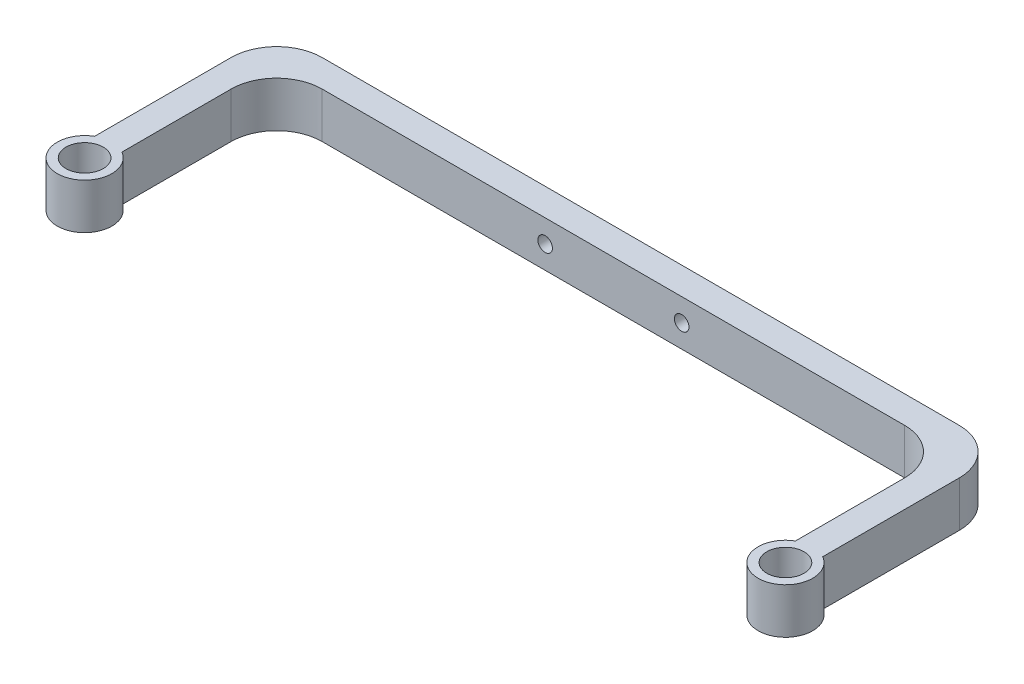
ISO-10303-21;
HEADER;
FILE_DESCRIPTION(('STEP AP214'),'2;1');
FILE_NAME('part.step','',(''),(''),'','','');
FILE_SCHEMA(('AUTOMOTIVE_DESIGN { 1 0 10303 214 1 1 1 1 }'));
ENDSEC;
DATA;
#1=APPLICATION_CONTEXT('core data for automotive mechanical design processes');
#2=APPLICATION_PROTOCOL_DEFINITION('international standard','automotive_design',2000,#1);
#3=PRODUCT_CONTEXT('',#1,'mechanical');
#4=PRODUCT('Part','Part','',(#3));
#5=PRODUCT_RELATED_PRODUCT_CATEGORY('part','',(#4));
#6=PRODUCT_DEFINITION_FORMATION('','',#4);
#7=PRODUCT_DEFINITION_CONTEXT('part definition',#1,'design');
#8=PRODUCT_DEFINITION('design','',#6,#7);
#9=PRODUCT_DEFINITION_SHAPE('','',#8);
#10=(LENGTH_UNIT() NAMED_UNIT(*) SI_UNIT(.MILLI.,.METRE.));
#11=(NAMED_UNIT(*) PLANE_ANGLE_UNIT() SI_UNIT($,.RADIAN.));
#12=(NAMED_UNIT(*) SI_UNIT($,.STERADIAN.) SOLID_ANGLE_UNIT());
#13=UNCERTAINTY_MEASURE_WITH_UNIT(LENGTH_MEASURE(1.E-05),#10,'distance_accuracy_value','');
#14=(GEOMETRIC_REPRESENTATION_CONTEXT(3) GLOBAL_UNCERTAINTY_ASSIGNED_CONTEXT((#13)) GLOBAL_UNIT_ASSIGNED_CONTEXT((#10,
#11,#12)) REPRESENTATION_CONTEXT('',''));
#15=CARTESIAN_POINT('',(0.,0.,0.));
#16=DIRECTION('',(0.,0.,1.));
#17=DIRECTION('',(1.,0.,0.));
#18=AXIS2_PLACEMENT_3D('',#15,#16,#17);
#19=CARTESIAN_POINT('',(93.4033149171271,10.,35.2928375055795));
#20=DIRECTION('',(0.,1.,0.));
#21=DIRECTION('',(0.,0.,1.));
#22=AXIS2_PLACEMENT_3D('',#19,#20,#21);
#23=PLANE('',#22);
#24=CARTESIAN_POINT('',(-60.5966850828729,10.,35.2928375055795));
#25=DIRECTION('',(0.,1.,0.));
#26=DIRECTION('',(0.,0.,1.));
#27=AXIS2_PLACEMENT_3D('',#24,#25,#26);
#28=CIRCLE('',#27,4.1);
#29=CARTESIAN_POINT('',(-60.5966850828729,10.,39.3928375055795));
#30=VERTEX_POINT('',#29);
#31=EDGE_CURVE('E222',#30,#30,#28,.T.);
#32=ORIENTED_EDGE('',*,*,#31,.F.);
#33=EDGE_LOOP('',(#32));
#34=FACE_BOUND('',#33,.T.);
#35=DIRECTION('',(-1.,0.,0.));
#36=VECTOR('',#35,1.);
#37=CARTESIAN_POINT('',(-63.5966850828729,10.,-9.90331491712708));
#38=LINE('',#37,#36);
#39=CARTESIAN_POINT('',(86.4033149171271,10.,-9.90331491712708));
#40=VERTEX_POINT('',#39);
#41=CARTESIAN_POINT('',(-53.5966850828729,10.,-9.90331491712708));
#42=VERTEX_POINT('',#41);
#43=EDGE_CURVE('E218',#40,#42,#38,.T.);
#44=ORIENTED_EDGE('',*,*,#43,.T.);
#45=CARTESIAN_POINT('',(-53.5966850828729,10.,0.0966850828729195));
#46=DIRECTION('',(0.,1.,0.));
#47=DIRECTION('',(0.,0.,1.));
#48=AXIS2_PLACEMENT_3D('',#45,#46,#47);
#49=CIRCLE('',#48,10.);
#50=CARTESIAN_POINT('',(-63.5966850828729,10.,0.0966850828729229));
#51=VERTEX_POINT('',#50);
#52=EDGE_CURVE('E132',#42,#51,#49,.T.);
#53=ORIENTED_EDGE('',*,*,#52,.T.);
#54=DIRECTION('',(0.,0.,1.));
#55=VECTOR('',#54,1.);
#56=CARTESIAN_POINT('',(-63.5966850828729,10.,30.0966850828729));
#57=LINE('',#56,#55);
#58=CARTESIAN_POINT('',(-63.5966850828729,10.,30.0966850828729));
#59=VERTEX_POINT('',#58);
#60=EDGE_CURVE('E125',#51,#59,#57,.T.);
#61=ORIENTED_EDGE('',*,*,#60,.T.);
#62=CARTESIAN_POINT('',(-60.5966850828729,10.,35.2928375055795));
#63=DIRECTION('',(0.,1.,0.));
#64=DIRECTION('',(0.,0.,1.));
#65=AXIS2_PLACEMENT_3D('',#62,#63,#64);
#66=CIRCLE('',#65,6.);
#67=CARTESIAN_POINT('',(-57.5966850828729,10.,30.0966850828729));
#68=VERTEX_POINT('',#67);
#69=EDGE_CURVE('E129',#59,#68,#66,.T.);
#70=ORIENTED_EDGE('',*,*,#69,.T.);
#71=DIRECTION('',(0.,0.,-1.));
#72=VECTOR('',#71,1.);
#73=CARTESIAN_POINT('',(-57.5966850828729,10.,-3.90331491712706));
#74=LINE('',#73,#72);
#75=CARTESIAN_POINT('',(-57.5966850828729,10.,6.09668508287294));
#76=VERTEX_POINT('',#75);
#77=EDGE_CURVE('E146',#68,#76,#74,.T.);
#78=ORIENTED_EDGE('',*,*,#77,.T.);
#79=CARTESIAN_POINT('',(-47.5966850828729,10.,6.09668508287294));
#80=DIRECTION('',(0.,1.,0.));
#81=DIRECTION('',(0.,0.,1.));
#82=AXIS2_PLACEMENT_3D('',#79,#80,#81);
#83=CIRCLE('',#82,10.);
#84=CARTESIAN_POINT('',(-47.5966850828729,10.,-3.90331491712706));
#85=VERTEX_POINT('',#84);
#86=EDGE_CURVE('E11',#76,#85,#83,.F.);
#87=ORIENTED_EDGE('',*,*,#86,.T.);
#88=DIRECTION('',(1.,0.,0.));
#89=VECTOR('',#88,1.);
#90=CARTESIAN_POINT('',(90.4033149171271,10.,-3.90331491712708));
#91=LINE('',#90,#89);
#92=CARTESIAN_POINT('',(80.4033149171271,10.,-3.90331491712708));
#93=VERTEX_POINT('',#92);
#94=EDGE_CURVE('E204',#85,#93,#91,.T.);
#95=ORIENTED_EDGE('',*,*,#94,.T.);
#96=CARTESIAN_POINT('',(80.4033149171271,10.,6.09668508287292));
#97=DIRECTION('',(0.,1.,0.));
#98=DIRECTION('',(0.,0.,1.));
#99=AXIS2_PLACEMENT_3D('',#96,#97,#98);
#100=CIRCLE('',#99,10.);
#101=CARTESIAN_POINT('',(90.4033149171271,10.,6.09668508287292));
#102=VERTEX_POINT('',#101);
#103=EDGE_CURVE('E183',#93,#102,#100,.F.);
#104=ORIENTED_EDGE('',*,*,#103,.T.);
#105=DIRECTION('',(0.,0.,1.));
#106=VECTOR('',#105,1.);
#107=CARTESIAN_POINT('',(90.4033149171271,10.,30.0966850828729));
#108=LINE('',#107,#106);
#109=CARTESIAN_POINT('',(90.4033149171271,10.,30.0966850828729));
#110=VERTEX_POINT('',#109);
#111=EDGE_CURVE('E209',#102,#110,#108,.T.);
#112=ORIENTED_EDGE('',*,*,#111,.T.);
#113=CARTESIAN_POINT('',(93.4033149171271,10.,35.2928375055795));
#114=DIRECTION('',(0.,1.,0.));
#115=DIRECTION('',(0.,0.,1.));
#116=AXIS2_PLACEMENT_3D('',#113,#114,#115);
#117=CIRCLE('',#116,6.);
#118=CARTESIAN_POINT('',(96.4033149171271,10.,30.0966850828729));
#119=VERTEX_POINT('',#118);
#120=EDGE_CURVE('E211',#110,#119,#117,.T.);
#121=ORIENTED_EDGE('',*,*,#120,.T.);
#122=DIRECTION('',(0.,0.,-1.));
#123=VECTOR('',#122,1.);
#124=CARTESIAN_POINT('',(96.4033149171271,10.,-9.90331491712708));
#125=LINE('',#124,#123);
#126=CARTESIAN_POINT('',(96.4033149171271,10.,0.0966850828729212));
#127=VERTEX_POINT('',#126);
#128=EDGE_CURVE('E216',#119,#127,#125,.T.);
#129=ORIENTED_EDGE('',*,*,#128,.T.);
#130=CARTESIAN_POINT('',(86.4033149171271,10.,0.0966850828729212));
#131=DIRECTION('',(0.,1.,0.));
#132=DIRECTION('',(0.,0.,1.));
#133=AXIS2_PLACEMENT_3D('',#130,#131,#132);
#134=CIRCLE('',#133,10.);
#135=EDGE_CURVE('E177',#127,#40,#134,.T.);
#136=ORIENTED_EDGE('',*,*,#135,.T.);
#137=EDGE_LOOP('',(#44,#53,#61,#70,#78,#87,#95,#104,#112,#121,#129,#136));
#138=FACE_BOUND('',#137,.T.);
#139=CARTESIAN_POINT('',(93.4033149171271,10.,35.2928375055795));
#140=DIRECTION('',(0.,1.,0.));
#141=DIRECTION('',(0.,0.,1.));
#142=AXIS2_PLACEMENT_3D('',#139,#140,#141);
#143=CIRCLE('',#142,4.09999999999999);
#144=CARTESIAN_POINT('',(93.4033149171271,10.,39.3928375055795));
#145=VERTEX_POINT('',#144);
#146=EDGE_CURVE('E317',#145,#145,#143,.T.);
#147=ORIENTED_EDGE('',*,*,#146,.F.);
#148=EDGE_LOOP('',(#147));
#149=FACE_BOUND('',#148,.T.);
#150=ADVANCED_FACE('F34',(#34,#138,#149),#23,.T.);
#151=CARTESIAN_POINT('',(93.4033149171271,0.,35.2928375055795));
#152=DIRECTION('',(0.,1.,0.));
#153=DIRECTION('',(0.,0.,1.));
#154=AXIS2_PLACEMENT_3D('',#151,#152,#153);
#155=PLANE('',#154);
#156=DIRECTION('',(0.,0.,1.));
#157=VECTOR('',#156,1.);
#158=CARTESIAN_POINT('',(-63.5966850828729,0.,30.0966850828729));
#159=LINE('',#158,#157);
#160=CARTESIAN_POINT('',(-63.5966850828729,0.,0.0966850828729229));
#161=VERTEX_POINT('',#160);
#162=CARTESIAN_POINT('',(-63.5966850828729,0.,30.0966850828729));
#163=VERTEX_POINT('',#162);
#164=EDGE_CURVE('E150',#161,#163,#159,.T.);
#165=ORIENTED_EDGE('',*,*,#164,.F.);
#166=CARTESIAN_POINT('',(-53.5966850828729,0.,0.0966850828729195));
#167=DIRECTION('',(0.,1.,0.));
#168=DIRECTION('',(0.,0.,1.));
#169=AXIS2_PLACEMENT_3D('',#166,#167,#168);
#170=CIRCLE('',#169,10.);
#171=CARTESIAN_POINT('',(-53.5966850828729,0.,-9.90331491712708));
#172=VERTEX_POINT('',#171);
#173=EDGE_CURVE('E171',#161,#172,#170,.F.);
#174=ORIENTED_EDGE('',*,*,#173,.T.);
#175=DIRECTION('',(-1.,0.,0.));
#176=VECTOR('',#175,1.);
#177=CARTESIAN_POINT('',(-63.5966850828729,0.,-9.90331491712708));
#178=LINE('',#177,#176);
#179=CARTESIAN_POINT('',(86.4033149171271,0.,-9.90331491712708));
#180=VERTEX_POINT('',#179);
#181=EDGE_CURVE('E137',#180,#172,#178,.T.);
#182=ORIENTED_EDGE('',*,*,#181,.F.);
#183=CARTESIAN_POINT('',(86.4033149171271,0.,0.0966850828729212));
#184=DIRECTION('',(0.,1.,0.));
#185=DIRECTION('',(0.,0.,1.));
#186=AXIS2_PLACEMENT_3D('',#183,#184,#185);
#187=CIRCLE('',#186,10.);
#188=CARTESIAN_POINT('',(96.4033149171271,0.,0.0966850828729212));
#189=VERTEX_POINT('',#188);
#190=EDGE_CURVE('E169',#180,#189,#187,.F.);
#191=ORIENTED_EDGE('',*,*,#190,.T.);
#192=DIRECTION('',(0.,0.,-1.));
#193=VECTOR('',#192,1.);
#194=CARTESIAN_POINT('',(96.4033149171271,0.,-9.90331491712708));
#195=LINE('',#194,#193);
#196=CARTESIAN_POINT('',(96.4033149171271,0.,30.0966850828729));
#197=VERTEX_POINT('',#196);
#198=EDGE_CURVE('E229',#197,#189,#195,.T.);
#199=ORIENTED_EDGE('',*,*,#198,.F.);
#200=CARTESIAN_POINT('',(93.4033149171271,0.,35.2928375055795));
#201=DIRECTION('',(0.,1.,0.));
#202=DIRECTION('',(0.,0.,1.));
#203=AXIS2_PLACEMENT_3D('',#200,#201,#202);
#204=CIRCLE('',#203,6.);
#205=CARTESIAN_POINT('',(90.4033149171271,0.,30.0966850828729));
#206=VERTEX_POINT('',#205);
#207=EDGE_CURVE('E227',#206,#197,#204,.T.);
#208=ORIENTED_EDGE('',*,*,#207,.F.);
#209=DIRECTION('',(0.,0.,1.));
#210=VECTOR('',#209,1.);
#211=CARTESIAN_POINT('',(90.4033149171271,0.,30.0966850828729));
#212=LINE('',#211,#210);
#213=CARTESIAN_POINT('',(90.4033149171271,0.,6.09668508287292));
#214=VERTEX_POINT('',#213);
#215=EDGE_CURVE('E225',#214,#206,#212,.T.);
#216=ORIENTED_EDGE('',*,*,#215,.F.);
#217=CARTESIAN_POINT('',(80.4033149171271,0.,6.09668508287292));
#218=DIRECTION('',(0.,1.,0.));
#219=DIRECTION('',(0.,0.,1.));
#220=AXIS2_PLACEMENT_3D('',#217,#218,#219);
#221=CIRCLE('',#220,10.);
#222=CARTESIAN_POINT('',(80.4033149171271,0.,-3.90331491712708));
#223=VERTEX_POINT('',#222);
#224=EDGE_CURVE('E181',#214,#223,#221,.T.);
#225=ORIENTED_EDGE('',*,*,#224,.T.);
#226=DIRECTION('',(1.,0.,0.));
#227=VECTOR('',#226,1.);
#228=CARTESIAN_POINT('',(90.4033149171271,0.,-3.90331491712708));
#229=LINE('',#228,#227);
#230=CARTESIAN_POINT('',(-47.5966850828729,0.,-3.90331491712706));
#231=VERTEX_POINT('',#230);
#232=EDGE_CURVE('E192',#231,#223,#229,.T.);
#233=ORIENTED_EDGE('',*,*,#232,.F.);
#234=CARTESIAN_POINT('',(-47.5966850828729,0.,6.09668508287294));
#235=DIRECTION('',(0.,1.,0.));
#236=DIRECTION('',(0.,0.,1.));
#237=AXIS2_PLACEMENT_3D('',#234,#235,#236);
#238=CIRCLE('',#237,10.);
#239=CARTESIAN_POINT('',(-57.5966850828729,0.,6.09668508287294));
#240=VERTEX_POINT('',#239);
#241=EDGE_CURVE('E42',#231,#240,#238,.T.);
#242=ORIENTED_EDGE('',*,*,#241,.T.);
#243=DIRECTION('',(0.,0.,-1.));
#244=VECTOR('',#243,1.);
#245=CARTESIAN_POINT('',(-57.5966850828729,0.,-3.90331491712706));
#246=LINE('',#245,#244);
#247=CARTESIAN_POINT('',(-57.5966850828729,0.,30.0966850828729));
#248=VERTEX_POINT('',#247);
#249=EDGE_CURVE('E190',#248,#240,#246,.T.);
#250=ORIENTED_EDGE('',*,*,#249,.F.);
#251=CARTESIAN_POINT('',(-60.5966850828729,0.,35.2928375055795));
#252=DIRECTION('',(0.,1.,0.));
#253=DIRECTION('',(0.,0.,1.));
#254=AXIS2_PLACEMENT_3D('',#251,#252,#253);
#255=CIRCLE('',#254,6.);
#256=EDGE_CURVE('E198',#163,#248,#255,.T.);
#257=ORIENTED_EDGE('',*,*,#256,.F.);
#258=EDGE_LOOP('',(#165,#174,#182,#191,#199,#208,#216,#225,#233,#242,#250,#257));
#259=FACE_BOUND('',#258,.T.);
#260=CARTESIAN_POINT('',(-60.5966850828729,0.,35.2928375055795));
#261=DIRECTION('',(0.,1.,0.));
#262=DIRECTION('',(0.,0.,1.));
#263=AXIS2_PLACEMENT_3D('',#260,#261,#262);
#264=CIRCLE('',#263,4.1);
#265=CARTESIAN_POINT('',(-60.5966850828729,0.,39.3928375055795));
#266=VERTEX_POINT('',#265);
#267=EDGE_CURVE('E324',#266,#266,#264,.T.);
#268=ORIENTED_EDGE('',*,*,#267,.T.);
#269=EDGE_LOOP('',(#268));
#270=FACE_BOUND('',#269,.T.);
#271=CARTESIAN_POINT('',(93.4033149171271,0.,35.2928375055795));
#272=DIRECTION('',(0.,1.,0.));
#273=DIRECTION('',(0.,0.,1.));
#274=AXIS2_PLACEMENT_3D('',#271,#272,#273);
#275=CIRCLE('',#274,4.09999999999999);
#276=CARTESIAN_POINT('',(93.4033149171271,0.,39.3928375055795));
#277=VERTEX_POINT('',#276);
#278=EDGE_CURVE('E320',#277,#277,#275,.T.);
#279=ORIENTED_EDGE('',*,*,#278,.T.);
#280=EDGE_LOOP('',(#279));
#281=FACE_BOUND('',#280,.T.);
#282=ADVANCED_FACE('F188',(#259,#270,#281),#155,.F.);
#283=CARTESIAN_POINT('',(-63.5966850828729,10.,30.0966850828729));
#284=DIRECTION('',(1.,0.,0.));
#285=DIRECTION('',(0.,0.,-1.));
#286=AXIS2_PLACEMENT_3D('',#283,#284,#285);
#287=PLANE('',#286);
#288=ORIENTED_EDGE('',*,*,#60,.F.);
#289=DIRECTION('',(0.,-1.,0.));
#290=VECTOR('',#289,1.);
#291=CARTESIAN_POINT('',(-63.5966850828729,10.,0.0966850828729229));
#292=LINE('',#291,#290);
#293=EDGE_CURVE('E167',#51,#161,#292,.T.);
#294=ORIENTED_EDGE('',*,*,#293,.T.);
#295=ORIENTED_EDGE('',*,*,#164,.T.);
#296=DIRECTION('',(0.,-1.,0.));
#297=VECTOR('',#296,1.);
#298=CARTESIAN_POINT('',(-63.5966850828729,10.,30.0966850828729));
#299=LINE('',#298,#297);
#300=EDGE_CURVE('E142',#59,#163,#299,.T.);
#301=ORIENTED_EDGE('',*,*,#300,.F.);
#302=EDGE_LOOP('',(#288,#294,#295,#301));
#303=FACE_BOUND('',#302,.T.);
#304=ADVANCED_FACE('F148',(#303),#287,.F.);
#305=CARTESIAN_POINT('',(-60.5966850828729,10.,35.2928375055795));
#306=DIRECTION('',(0.,-1.,0.));
#307=DIRECTION('',(0.,0.,-1.));
#308=AXIS2_PLACEMENT_3D('',#305,#306,#307);
#309=CYLINDRICAL_SURFACE('',#308,6.);
#310=ORIENTED_EDGE('',*,*,#256,.T.);
#311=DIRECTION('',(0.,-1.,0.));
#312=VECTOR('',#311,1.);
#313=CARTESIAN_POINT('',(-57.5966850828729,10.,30.0966850828729));
#314=LINE('',#313,#312);
#315=EDGE_CURVE('E144',#68,#248,#314,.T.);
#316=ORIENTED_EDGE('',*,*,#315,.F.);
#317=ORIENTED_EDGE('',*,*,#69,.F.);
#318=ORIENTED_EDGE('',*,*,#300,.T.);
#319=EDGE_LOOP('',(#310,#316,#317,#318));
#320=FACE_BOUND('',#319,.T.);
#321=ADVANCED_FACE('F141',(#320),#309,.T.);
#322=CARTESIAN_POINT('',(-57.5966850828729,10.,-3.90331491712706));
#323=DIRECTION('',(-1.,0.,0.));
#324=DIRECTION('',(0.,0.,1.));
#325=AXIS2_PLACEMENT_3D('',#322,#323,#324);
#326=PLANE('',#325);
#327=ORIENTED_EDGE('',*,*,#249,.T.);
#328=DIRECTION('',(0.,-1.,0.));
#329=VECTOR('',#328,1.);
#330=CARTESIAN_POINT('',(-57.5966850828729,10.,6.09668508287294));
#331=LINE('',#330,#329);
#332=EDGE_CURVE('E165',#240,#76,#331,.F.);
#333=ORIENTED_EDGE('',*,*,#332,.T.);
#334=ORIENTED_EDGE('',*,*,#77,.F.);
#335=ORIENTED_EDGE('',*,*,#315,.T.);
#336=EDGE_LOOP('',(#327,#333,#334,#335));
#337=FACE_BOUND('',#336,.T.);
#338=ADVANCED_FACE('F197',(#337),#326,.F.);
#339=CARTESIAN_POINT('',(90.4033149171271,10.,-3.90331491712708));
#340=DIRECTION('',(0.,0.,-1.));
#341=DIRECTION('',(-1.,0.,0.));
#342=AXIS2_PLACEMENT_3D('',#339,#340,#341);
#343=PLANE('',#342);
#344=CARTESIAN_POINT('',(31.4033149171271,4.99999999999999,-3.90331491712707));
#345=DIRECTION('',(0.,0.,-1.));
#346=DIRECTION('',(-1.,0.,0.));
#347=AXIS2_PLACEMENT_3D('',#344,#345,#346);
#348=CIRCLE('',#347,1.6);
#349=CARTESIAN_POINT('',(29.8033149171271,4.99999999999999,-3.90331491712707));
#350=VERTEX_POINT('',#349);
#351=EDGE_CURVE('E338',#350,#350,#348,.T.);
#352=ORIENTED_EDGE('',*,*,#351,.T.);
#353=EDGE_LOOP('',(#352));
#354=FACE_BOUND('',#353,.T.);
#355=CARTESIAN_POINT('',(1.40331491712708,4.99999999999999,-3.90331491712707));
#356=DIRECTION('',(0.,0.,-1.));
#357=DIRECTION('',(-1.,0.,0.));
#358=AXIS2_PLACEMENT_3D('',#355,#356,#357);
#359=CIRCLE('',#358,1.6);
#360=CARTESIAN_POINT('',(-0.196685082872923,4.99999999999999,-3.90331491712707));
#361=VERTEX_POINT('',#360);
#362=EDGE_CURVE('E322',#361,#361,#359,.T.);
#363=ORIENTED_EDGE('',*,*,#362,.T.);
#364=EDGE_LOOP('',(#363));
#365=FACE_BOUND('',#364,.T.);
#366=ORIENTED_EDGE('',*,*,#232,.T.);
#367=DIRECTION('',(0.,-1.,0.));
#368=VECTOR('',#367,1.);
#369=CARTESIAN_POINT('',(80.4033149171271,10.,-3.90331491712708));
#370=LINE('',#369,#368);
#371=EDGE_CURVE('E163',#223,#93,#370,.F.);
#372=ORIENTED_EDGE('',*,*,#371,.T.);
#373=ORIENTED_EDGE('',*,*,#94,.F.);
#374=DIRECTION('',(0.,-1.,0.));
#375=VECTOR('',#374,1.);
#376=CARTESIAN_POINT('',(-47.5966850828729,0.,-3.90331491712706));
#377=LINE('',#376,#375);
#378=EDGE_CURVE('E155',#85,#231,#377,.T.);
#379=ORIENTED_EDGE('',*,*,#378,.T.);
#380=EDGE_LOOP('',(#366,#372,#373,#379));
#381=FACE_BOUND('',#380,.T.);
#382=ADVANCED_FACE('F207',(#354,#365,#381),#343,.F.);
#383=CARTESIAN_POINT('',(90.4033149171271,10.,30.0966850828729));
#384=DIRECTION('',(1.,0.,0.));
#385=DIRECTION('',(0.,0.,-1.));
#386=AXIS2_PLACEMENT_3D('',#383,#384,#385);
#387=PLANE('',#386);
#388=ORIENTED_EDGE('',*,*,#111,.F.);
#389=DIRECTION('',(0.,-1.,0.));
#390=VECTOR('',#389,1.);
#391=CARTESIAN_POINT('',(90.4033149171271,0.,6.09668508287292));
#392=LINE('',#391,#390);
#393=EDGE_CURVE('E152',#102,#214,#392,.T.);
#394=ORIENTED_EDGE('',*,*,#393,.T.);
#395=ORIENTED_EDGE('',*,*,#215,.T.);
#396=DIRECTION('',(0.,-1.,0.));
#397=VECTOR('',#396,1.);
#398=CARTESIAN_POINT('',(90.4033149171271,10.,30.0966850828729));
#399=LINE('',#398,#397);
#400=EDGE_CURVE('E157',#110,#206,#399,.T.);
#401=ORIENTED_EDGE('',*,*,#400,.F.);
#402=EDGE_LOOP('',(#388,#394,#395,#401));
#403=FACE_BOUND('',#402,.T.);
#404=ADVANCED_FACE('F278',(#403),#387,.F.);
#405=CARTESIAN_POINT('',(93.4033149171271,10.,35.2928375055795));
#406=DIRECTION('',(0.,-1.,0.));
#407=DIRECTION('',(0.,0.,-1.));
#408=AXIS2_PLACEMENT_3D('',#405,#406,#407);
#409=CYLINDRICAL_SURFACE('',#408,6.);
#410=ORIENTED_EDGE('',*,*,#207,.T.);
#411=DIRECTION('',(0.,-1.,0.));
#412=VECTOR('',#411,1.);
#413=CARTESIAN_POINT('',(96.4033149171271,10.,30.0966850828729));
#414=LINE('',#413,#412);
#415=EDGE_CURVE('E220',#119,#197,#414,.T.);
#416=ORIENTED_EDGE('',*,*,#415,.F.);
#417=ORIENTED_EDGE('',*,*,#120,.F.);
#418=ORIENTED_EDGE('',*,*,#400,.T.);
#419=EDGE_LOOP('',(#410,#416,#417,#418));
#420=FACE_BOUND('',#419,.T.);
#421=ADVANCED_FACE('F238',(#420),#409,.T.);
#422=CARTESIAN_POINT('',(96.4033149171271,10.,-9.90331491712708));
#423=DIRECTION('',(-1.,0.,0.));
#424=DIRECTION('',(0.,0.,1.));
#425=AXIS2_PLACEMENT_3D('',#422,#423,#424);
#426=PLANE('',#425);
#427=ORIENTED_EDGE('',*,*,#198,.T.);
#428=DIRECTION('',(0.,-1.,0.));
#429=VECTOR('',#428,1.);
#430=CARTESIAN_POINT('',(96.4033149171271,10.,0.0966850828729212));
#431=LINE('',#430,#429);
#432=EDGE_CURVE('E49',#189,#127,#431,.F.);
#433=ORIENTED_EDGE('',*,*,#432,.T.);
#434=ORIENTED_EDGE('',*,*,#128,.F.);
#435=ORIENTED_EDGE('',*,*,#415,.T.);
#436=EDGE_LOOP('',(#427,#433,#434,#435));
#437=FACE_BOUND('',#436,.T.);
#438=ADVANCED_FACE('F245',(#437),#426,.F.);
#439=CARTESIAN_POINT('',(-63.5966850828729,10.,-9.90331491712708));
#440=DIRECTION('',(0.,0.,1.));
#441=DIRECTION('',(1.,0.,0.));
#442=AXIS2_PLACEMENT_3D('',#439,#440,#441);
#443=PLANE('',#442);
#444=CARTESIAN_POINT('',(31.4033149171271,4.99999999999999,-9.90331491712708));
#445=DIRECTION('',(0.,0.,-1.));
#446=DIRECTION('',(-1.,0.,0.));
#447=AXIS2_PLACEMENT_3D('',#444,#445,#446);
#448=CIRCLE('',#447,1.6);
#449=CARTESIAN_POINT('',(29.8033149171271,4.99999999999999,-9.90331491712708));
#450=VERTEX_POINT('',#449);
#451=EDGE_CURVE('E341',#450,#450,#448,.T.);
#452=ORIENTED_EDGE('',*,*,#451,.F.);
#453=EDGE_LOOP('',(#452));
#454=FACE_BOUND('',#453,.T.);
#455=CARTESIAN_POINT('',(1.40331491712708,4.99999999999999,-9.90331491712708));
#456=DIRECTION('',(0.,0.,-1.));
#457=DIRECTION('',(-1.,0.,0.));
#458=AXIS2_PLACEMENT_3D('',#455,#456,#457);
#459=CIRCLE('',#458,1.6);
#460=CARTESIAN_POINT('',(-0.196685082872923,4.99999999999999,-9.90331491712708));
#461=VERTEX_POINT('',#460);
#462=EDGE_CURVE('E327',#461,#461,#459,.T.);
#463=ORIENTED_EDGE('',*,*,#462,.F.);
#464=EDGE_LOOP('',(#463));
#465=FACE_BOUND('',#464,.T.);
#466=ORIENTED_EDGE('',*,*,#181,.T.);
#467=DIRECTION('',(0.,-1.,0.));
#468=VECTOR('',#467,1.);
#469=CARTESIAN_POINT('',(-53.5966850828729,10.,-9.90331491712708));
#470=LINE('',#469,#468);
#471=EDGE_CURVE('E57',#172,#42,#470,.F.);
#472=ORIENTED_EDGE('',*,*,#471,.T.);
#473=ORIENTED_EDGE('',*,*,#43,.F.);
#474=DIRECTION('',(0.,-1.,0.));
#475=VECTOR('',#474,1.);
#476=CARTESIAN_POINT('',(86.4033149171271,10.,-9.90331491712708));
#477=LINE('',#476,#475);
#478=EDGE_CURVE('E173',#40,#180,#477,.T.);
#479=ORIENTED_EDGE('',*,*,#478,.T.);
#480=EDGE_LOOP('',(#466,#472,#473,#479));
#481=FACE_BOUND('',#480,.T.);
#482=ADVANCED_FACE('F249',(#454,#465,#481),#443,.F.);
#483=CARTESIAN_POINT('',(-60.5966850828729,10.,35.2928375055795));
#484=DIRECTION('',(0.,-1.,0.));
#485=DIRECTION('',(0.,0.,-1.));
#486=AXIS2_PLACEMENT_3D('',#483,#484,#485);
#487=CYLINDRICAL_SURFACE('',#486,4.1);
#488=ORIENTED_EDGE('',*,*,#31,.T.);
#489=EDGE_LOOP('',(#488));
#490=FACE_BOUND('',#489,.T.);
#491=ORIENTED_EDGE('',*,*,#267,.F.);
#492=EDGE_LOOP('',(#491));
#493=FACE_BOUND('',#492,.T.);
#494=ADVANCED_FACE('F268',(#490,#493),#487,.F.);
#495=CARTESIAN_POINT('',(93.4033149171271,10.,35.2928375055795));
#496=DIRECTION('',(0.,-1.,0.));
#497=DIRECTION('',(0.,0.,-1.));
#498=AXIS2_PLACEMENT_3D('',#495,#496,#497);
#499=CYLINDRICAL_SURFACE('',#498,4.09999999999999);
#500=ORIENTED_EDGE('',*,*,#146,.T.);
#501=EDGE_LOOP('',(#500));
#502=FACE_BOUND('',#501,.T.);
#503=ORIENTED_EDGE('',*,*,#278,.F.);
#504=EDGE_LOOP('',(#503));
#505=FACE_BOUND('',#504,.T.);
#506=ADVANCED_FACE('F303',(#502,#505),#499,.F.);
#507=CARTESIAN_POINT('',(1.40331491712708,4.99999999999999,41.2928375055795));
#508=DIRECTION('',(0.,0.,-1.));
#509=DIRECTION('',(-1.,0.,0.));
#510=AXIS2_PLACEMENT_3D('',#507,#508,#509);
#511=CYLINDRICAL_SURFACE('',#510,1.6);
#512=ORIENTED_EDGE('',*,*,#462,.T.);
#513=EDGE_LOOP('',(#512));
#514=FACE_BOUND('',#513,.T.);
#515=ORIENTED_EDGE('',*,*,#362,.F.);
#516=EDGE_LOOP('',(#515));
#517=FACE_BOUND('',#516,.T.);
#518=ADVANCED_FACE('F296',(#514,#517),#511,.F.);
#519=CARTESIAN_POINT('',(31.4033149171271,4.99999999999999,41.2928375055795));
#520=DIRECTION('',(0.,0.,-1.));
#521=DIRECTION('',(-1.,0.,0.));
#522=AXIS2_PLACEMENT_3D('',#519,#520,#521);
#523=CYLINDRICAL_SURFACE('',#522,1.6);
#524=ORIENTED_EDGE('',*,*,#451,.T.);
#525=EDGE_LOOP('',(#524));
#526=FACE_BOUND('',#525,.T.);
#527=ORIENTED_EDGE('',*,*,#351,.F.);
#528=EDGE_LOOP('',(#527));
#529=FACE_BOUND('',#528,.T.);
#530=ADVANCED_FACE('F291',(#526,#529),#523,.F.);
#531=CARTESIAN_POINT('',(80.4033149171271,10.,6.09668508287292));
#532=DIRECTION('',(0.,1.,0.));
#533=DIRECTION('',(0.,0.,1.));
#534=AXIS2_PLACEMENT_3D('',#531,#532,#533);
#535=CYLINDRICAL_SURFACE('',#534,10.);
#536=ORIENTED_EDGE('',*,*,#103,.F.);
#537=ORIENTED_EDGE('',*,*,#371,.F.);
#538=ORIENTED_EDGE('',*,*,#224,.F.);
#539=ORIENTED_EDGE('',*,*,#393,.F.);
#540=EDGE_LOOP('',(#536,#537,#538,#539));
#541=FACE_BOUND('',#540,.T.);
#542=ADVANCED_FACE('F257',(#541),#535,.F.);
#543=CARTESIAN_POINT('',(-47.5966850828729,10.,6.09668508287294));
#544=DIRECTION('',(0.,1.,0.));
#545=DIRECTION('',(0.,0.,1.));
#546=AXIS2_PLACEMENT_3D('',#543,#544,#545);
#547=CYLINDRICAL_SURFACE('',#546,10.);
#548=ORIENTED_EDGE('',*,*,#86,.F.);
#549=ORIENTED_EDGE('',*,*,#332,.F.);
#550=ORIENTED_EDGE('',*,*,#241,.F.);
#551=ORIENTED_EDGE('',*,*,#378,.F.);
#552=EDGE_LOOP('',(#548,#549,#550,#551));
#553=FACE_BOUND('',#552,.T.);
#554=ADVANCED_FACE('F201',(#553),#547,.F.);
#555=CARTESIAN_POINT('',(-53.5966850828729,10.,0.0966850828729195));
#556=DIRECTION('',(0.,-1.,0.));
#557=DIRECTION('',(0.,0.,-1.));
#558=AXIS2_PLACEMENT_3D('',#555,#556,#557);
#559=CYLINDRICAL_SURFACE('',#558,10.);
#560=ORIENTED_EDGE('',*,*,#52,.F.);
#561=ORIENTED_EDGE('',*,*,#471,.F.);
#562=ORIENTED_EDGE('',*,*,#173,.F.);
#563=ORIENTED_EDGE('',*,*,#293,.F.);
#564=EDGE_LOOP('',(#560,#561,#562,#563));
#565=FACE_BOUND('',#564,.T.);
#566=ADVANCED_FACE('F251',(#565),#559,.T.);
#567=CARTESIAN_POINT('',(86.4033149171271,10.,0.0966850828729212));
#568=DIRECTION('',(0.,-1.,0.));
#569=DIRECTION('',(0.,0.,-1.));
#570=AXIS2_PLACEMENT_3D('',#567,#568,#569);
#571=CYLINDRICAL_SURFACE('',#570,10.);
#572=ORIENTED_EDGE('',*,*,#135,.F.);
#573=ORIENTED_EDGE('',*,*,#432,.F.);
#574=ORIENTED_EDGE('',*,*,#190,.F.);
#575=ORIENTED_EDGE('',*,*,#478,.F.);
#576=EDGE_LOOP('',(#572,#573,#574,#575));
#577=FACE_BOUND('',#576,.T.);
#578=ADVANCED_FACE('F36',(#577),#571,.T.);
#579=CLOSED_SHELL('',(#150,#282,#304,#321,#338,#382,#404,#421,#438,#482,#494,#506,#518,#530,
#542,#554,#566,#578));
#580=MANIFOLD_SOLID_BREP('B2',#579);
#581=ADVANCED_BREP_SHAPE_REPRESENTATION('',(#18,#580),#14);
#582=SHAPE_DEFINITION_REPRESENTATION(#9,#581);
ENDSEC;
END-ISO-10303-21;
